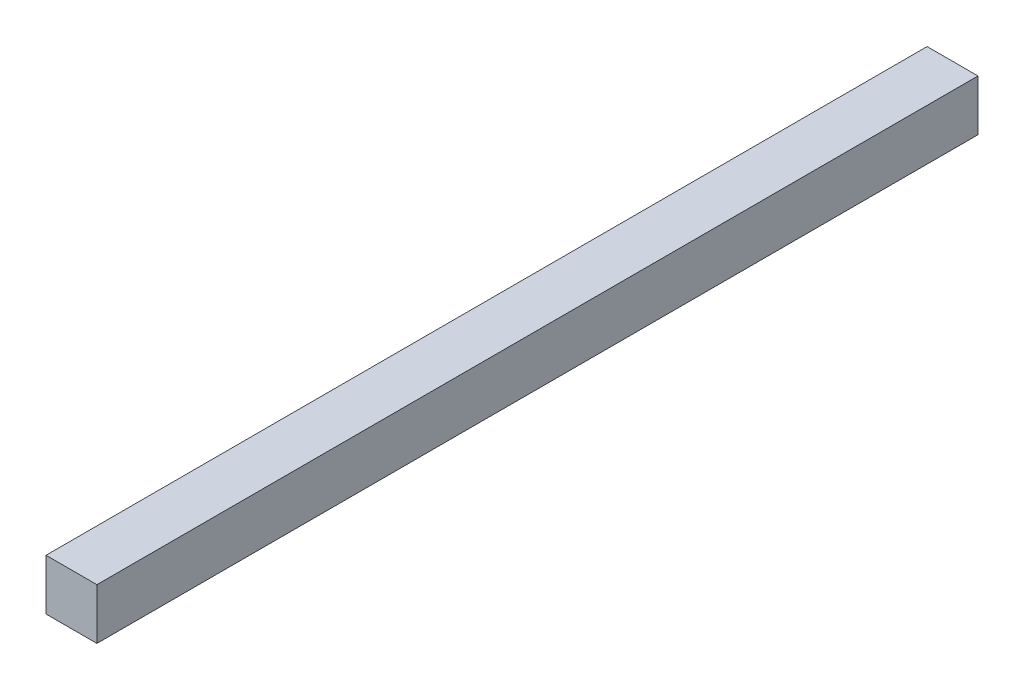
ISO-10303-21;
HEADER;
FILE_DESCRIPTION(('STEP AP214'),'2;1');
FILE_NAME('part.step','',(''),(''),'','','');
FILE_SCHEMA(('AUTOMOTIVE_DESIGN { 1 0 10303 214 1 1 1 1 }'));
ENDSEC;
DATA;
#1=APPLICATION_CONTEXT('core data for automotive mechanical design processes');
#2=APPLICATION_PROTOCOL_DEFINITION('international standard','automotive_design',2000,#1);
#3=PRODUCT_CONTEXT('',#1,'mechanical');
#4=PRODUCT('Part','Part','',(#3));
#5=PRODUCT_RELATED_PRODUCT_CATEGORY('part','',(#4));
#6=PRODUCT_DEFINITION_FORMATION('','',#4);
#7=PRODUCT_DEFINITION_CONTEXT('part definition',#1,'design');
#8=PRODUCT_DEFINITION('design','',#6,#7);
#9=PRODUCT_DEFINITION_SHAPE('','',#8);
#10=(LENGTH_UNIT() NAMED_UNIT(*) SI_UNIT(.MILLI.,.METRE.));
#11=(NAMED_UNIT(*) PLANE_ANGLE_UNIT() SI_UNIT($,.RADIAN.));
#12=(NAMED_UNIT(*) SI_UNIT($,.STERADIAN.) SOLID_ANGLE_UNIT());
#13=UNCERTAINTY_MEASURE_WITH_UNIT(LENGTH_MEASURE(1.E-05),#10,'distance_accuracy_value','');
#14=(GEOMETRIC_REPRESENTATION_CONTEXT(3) GLOBAL_UNCERTAINTY_ASSIGNED_CONTEXT((#13)) GLOBAL_UNIT_ASSIGNED_CONTEXT((#10,
#11,#12)) REPRESENTATION_CONTEXT('',''));
#15=CARTESIAN_POINT('',(0.,0.,0.));
#16=DIRECTION('',(0.,0.,1.));
#17=DIRECTION('',(1.,0.,0.));
#18=AXIS2_PLACEMENT_3D('',#15,#16,#17);
#19=CARTESIAN_POINT('',(-3.81,12.25,-8.25));
#20=DIRECTION('',(0.,0.,-1.));
#21=DIRECTION('',(0.,-1.,0.));
#22=AXIS2_PLACEMENT_3D('',#19,#20,#21);
#23=PLANE('',#22);
#24=DIRECTION('',(-1.,0.,0.));
#25=VECTOR('',#24,1.);
#26=CARTESIAN_POINT('',(-3.485,11.925,-8.25));
#27=LINE('',#26,#25);
#28=CARTESIAN_POINT('',(-3.485,11.925,-8.25));
#29=VERTEX_POINT('',#28);
#30=CARTESIAN_POINT('',(-4.135,11.925,-8.25));
#31=VERTEX_POINT('',#30);
#32=EDGE_CURVE('E11',#29,#31,#27,.T.);
#33=ORIENTED_EDGE('',*,*,#32,.T.);
#34=DIRECTION('',(0.,1.,0.));
#35=VECTOR('',#34,1.);
#36=CARTESIAN_POINT('',(-4.135,11.925,-8.25));
#37=LINE('',#36,#35);
#38=CARTESIAN_POINT('',(-4.135,12.575,-8.25));
#39=VERTEX_POINT('',#38);
#40=EDGE_CURVE('E20',#31,#39,#37,.T.);
#41=ORIENTED_EDGE('',*,*,#40,.T.);
#42=DIRECTION('',(1.,0.,0.));
#43=VECTOR('',#42,1.);
#44=CARTESIAN_POINT('',(-4.135,12.575,-8.25));
#45=LINE('',#44,#43);
#46=CARTESIAN_POINT('',(-3.485,12.575,-8.25));
#47=VERTEX_POINT('',#46);
#48=EDGE_CURVE('E80',#39,#47,#45,.T.);
#49=ORIENTED_EDGE('',*,*,#48,.T.);
#50=DIRECTION('',(0.,-1.,0.));
#51=VECTOR('',#50,1.);
#52=CARTESIAN_POINT('',(-3.485,12.575,-8.25));
#53=LINE('',#52,#51);
#54=EDGE_CURVE('E82',#47,#29,#53,.T.);
#55=ORIENTED_EDGE('',*,*,#54,.T.);
#56=EDGE_LOOP('',(#33,#41,#49,#55));
#57=FACE_BOUND('',#56,.T.);
#58=ADVANCED_FACE('F16',(#57),#23,.T.);
#59=CARTESIAN_POINT('',(-4.135,12.575,1.));
#60=DIRECTION('',(-1.,0.,0.));
#61=DIRECTION('',(0.,0.,1.));
#62=AXIS2_PLACEMENT_3D('',#59,#60,#61);
#63=PLANE('',#62);
#64=DIRECTION('',(0.,0.,-1.));
#65=VECTOR('',#64,1.);
#66=CARTESIAN_POINT('',(-4.135,11.925,1.));
#67=LINE('',#66,#65);
#68=CARTESIAN_POINT('',(-4.135,11.925,3.));
#69=VERTEX_POINT('',#68);
#70=EDGE_CURVE('E67',#69,#31,#67,.T.);
#71=ORIENTED_EDGE('',*,*,#70,.F.);
#72=DIRECTION('',(0.,-1.,0.));
#73=VECTOR('',#72,1.);
#74=CARTESIAN_POINT('',(-4.135,11.925,3.));
#75=LINE('',#74,#73);
#76=CARTESIAN_POINT('',(-4.135,12.575,3.));
#77=VERTEX_POINT('',#76);
#78=EDGE_CURVE('E63',#77,#69,#75,.T.);
#79=ORIENTED_EDGE('',*,*,#78,.F.);
#80=DIRECTION('',(0.,0.,1.));
#81=VECTOR('',#80,1.);
#82=CARTESIAN_POINT('',(-4.135,12.575,1.));
#83=LINE('',#82,#81);
#84=EDGE_CURVE('E65',#39,#77,#83,.T.);
#85=ORIENTED_EDGE('',*,*,#84,.F.);
#86=ORIENTED_EDGE('',*,*,#40,.F.);
#87=EDGE_LOOP('',(#71,#79,#85,#86));
#88=FACE_BOUND('',#87,.T.);
#89=ADVANCED_FACE('F18',(#88),#63,.T.);
#90=CARTESIAN_POINT('',(-3.485,12.575,1.));
#91=DIRECTION('',(0.,1.,0.));
#92=DIRECTION('',(1.,0.,0.));
#93=AXIS2_PLACEMENT_3D('',#90,#91,#92);
#94=PLANE('',#93);
#95=ORIENTED_EDGE('',*,*,#84,.T.);
#96=DIRECTION('',(-1.,0.,0.));
#97=VECTOR('',#96,1.);
#98=CARTESIAN_POINT('',(-4.135,12.575,3.));
#99=LINE('',#98,#97);
#100=CARTESIAN_POINT('',(-3.485,12.575,3.));
#101=VERTEX_POINT('',#100);
#102=EDGE_CURVE('E73',#101,#77,#99,.T.);
#103=ORIENTED_EDGE('',*,*,#102,.F.);
#104=DIRECTION('',(0.,0.,1.));
#105=VECTOR('',#104,1.);
#106=CARTESIAN_POINT('',(-3.485,12.575,1.));
#107=LINE('',#106,#105);
#108=EDGE_CURVE('E83',#47,#101,#107,.T.);
#109=ORIENTED_EDGE('',*,*,#108,.F.);
#110=ORIENTED_EDGE('',*,*,#48,.F.);
#111=EDGE_LOOP('',(#95,#103,#109,#110));
#112=FACE_BOUND('',#111,.T.);
#113=ADVANCED_FACE('F76',(#112),#94,.T.);
#114=CARTESIAN_POINT('',(-3.485,11.925,1.));
#115=DIRECTION('',(1.,0.,0.));
#116=DIRECTION('',(0.,1.,0.));
#117=AXIS2_PLACEMENT_3D('',#114,#115,#116);
#118=PLANE('',#117);
#119=ORIENTED_EDGE('',*,*,#108,.T.);
#120=DIRECTION('',(0.,1.,0.));
#121=VECTOR('',#120,1.);
#122=CARTESIAN_POINT('',(-3.485,12.575,3.));
#123=LINE('',#122,#121);
#124=CARTESIAN_POINT('',(-3.485,11.925,3.));
#125=VERTEX_POINT('',#124);
#126=EDGE_CURVE('E88',#125,#101,#123,.T.);
#127=ORIENTED_EDGE('',*,*,#126,.F.);
#128=DIRECTION('',(0.,0.,1.));
#129=VECTOR('',#128,1.);
#130=CARTESIAN_POINT('',(-3.485,11.925,1.));
#131=LINE('',#130,#129);
#132=EDGE_CURVE('E100',#29,#125,#131,.T.);
#133=ORIENTED_EDGE('',*,*,#132,.F.);
#134=ORIENTED_EDGE('',*,*,#54,.F.);
#135=EDGE_LOOP('',(#119,#127,#133,#134));
#136=FACE_BOUND('',#135,.T.);
#137=ADVANCED_FACE('F111',(#136),#118,.T.);
#138=CARTESIAN_POINT('',(-4.135,11.925,1.));
#139=DIRECTION('',(0.,-1.,0.));
#140=DIRECTION('',(0.,0.,-1.));
#141=AXIS2_PLACEMENT_3D('',#138,#139,#140);
#142=PLANE('',#141);
#143=ORIENTED_EDGE('',*,*,#132,.T.);
#144=DIRECTION('',(1.,0.,0.));
#145=VECTOR('',#144,1.);
#146=CARTESIAN_POINT('',(-3.485,11.925,3.));
#147=LINE('',#146,#145);
#148=EDGE_CURVE('E95',#69,#125,#147,.T.);
#149=ORIENTED_EDGE('',*,*,#148,.F.);
#150=ORIENTED_EDGE('',*,*,#70,.T.);
#151=ORIENTED_EDGE('',*,*,#32,.F.);
#152=EDGE_LOOP('',(#143,#149,#150,#151));
#153=FACE_BOUND('',#152,.T.);
#154=ADVANCED_FACE('F136',(#153),#142,.T.);
#155=CARTESIAN_POINT('',(-3.81,12.25,3.));
#156=DIRECTION('',(0.,0.,1.));
#157=DIRECTION('',(1.,0.,0.));
#158=AXIS2_PLACEMENT_3D('',#155,#156,#157);
#159=PLANE('',#158);
#160=ORIENTED_EDGE('',*,*,#148,.T.);
#161=ORIENTED_EDGE('',*,*,#126,.T.);
#162=ORIENTED_EDGE('',*,*,#102,.T.);
#163=ORIENTED_EDGE('',*,*,#78,.T.);
#164=EDGE_LOOP('',(#160,#161,#162,#163));
#165=FACE_BOUND('',#164,.T.);
#166=ADVANCED_FACE('F86',(#165),#159,.T.);
#167=CLOSED_SHELL('',(#58,#89,#113,#137,#154,#166));
#168=MANIFOLD_SOLID_BREP('B1',#167);
#169=ADVANCED_BREP_SHAPE_REPRESENTATION('',(#18,#168),#14);
#170=SHAPE_DEFINITION_REPRESENTATION(#9,#169);
ENDSEC;
END-ISO-10303-21;
